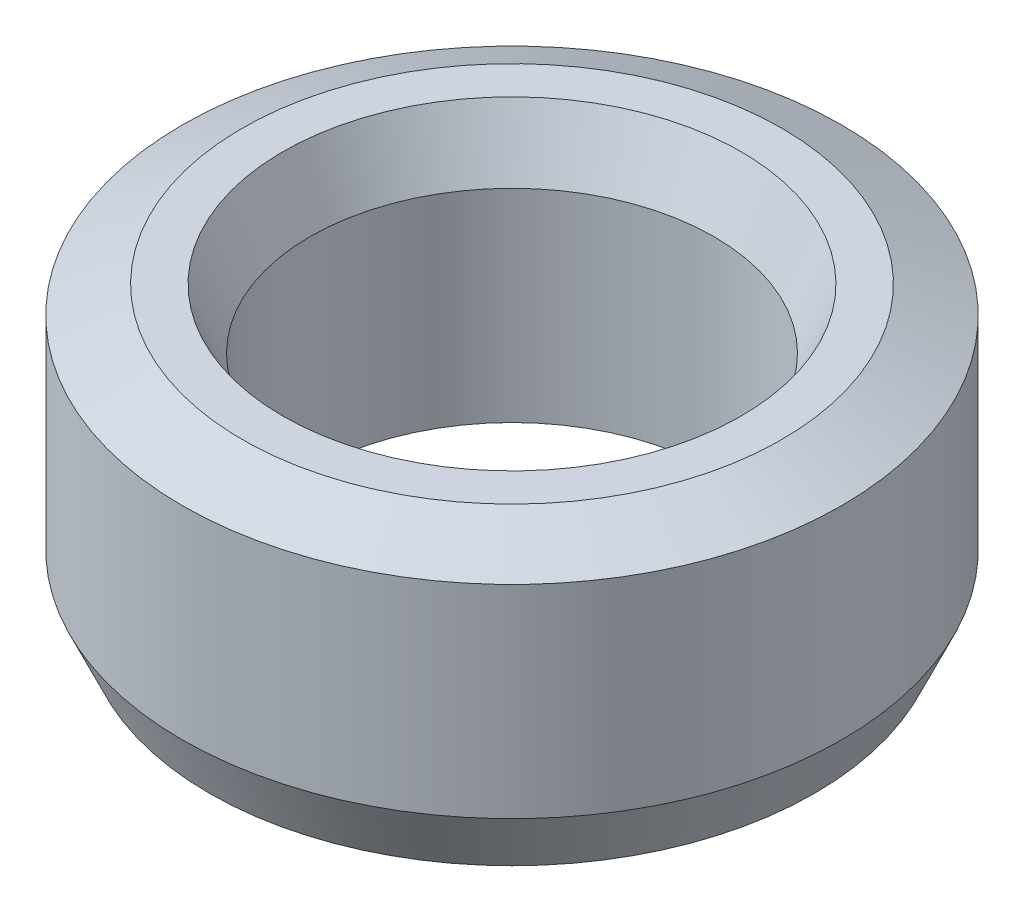
ISO-10303-21;
HEADER;
FILE_DESCRIPTION(('STEP AP214'),'2;1');
FILE_NAME('part.step','',(''),(''),'','','');
FILE_SCHEMA(('AUTOMOTIVE_DESIGN { 1 0 10303 214 1 1 1 1 }'));
ENDSEC;
DATA;
#1=APPLICATION_CONTEXT('core data for automotive mechanical design processes');
#2=APPLICATION_PROTOCOL_DEFINITION('international standard','automotive_design',2000,#1);
#3=PRODUCT_CONTEXT('',#1,'mechanical');
#4=PRODUCT('Part','Part','',(#3));
#5=PRODUCT_RELATED_PRODUCT_CATEGORY('part','',(#4));
#6=PRODUCT_DEFINITION_FORMATION('','',#4);
#7=PRODUCT_DEFINITION_CONTEXT('part definition',#1,'design');
#8=PRODUCT_DEFINITION('design','',#6,#7);
#9=PRODUCT_DEFINITION_SHAPE('','',#8);
#10=(LENGTH_UNIT() NAMED_UNIT(*) SI_UNIT(.MILLI.,.METRE.));
#11=(NAMED_UNIT(*) PLANE_ANGLE_UNIT() SI_UNIT($,.RADIAN.));
#12=(NAMED_UNIT(*) SI_UNIT($,.STERADIAN.) SOLID_ANGLE_UNIT());
#13=UNCERTAINTY_MEASURE_WITH_UNIT(LENGTH_MEASURE(1.E-05),#10,'distance_accuracy_value','');
#14=(GEOMETRIC_REPRESENTATION_CONTEXT(3) GLOBAL_UNCERTAINTY_ASSIGNED_CONTEXT((#13)) GLOBAL_UNIT_ASSIGNED_CONTEXT((#10,
#11,#12)) REPRESENTATION_CONTEXT('',''));
#15=CARTESIAN_POINT('',(0.,0.,0.));
#16=DIRECTION('',(0.,0.,1.));
#17=DIRECTION('',(1.,0.,0.));
#18=AXIS2_PLACEMENT_3D('',#15,#16,#17);
#19=CARTESIAN_POINT('',(0.,32.9867287299585,0.));
#20=DIRECTION('',(0.,-1.,0.));
#21=DIRECTION('',(0.,0.,-1.));
#22=AXIS2_PLACEMENT_3D('',#19,#20,#21);
#23=CYLINDRICAL_SURFACE('',#22,37.5);
#24=CARTESIAN_POINT('',(0.,6.82147116967166,0.));
#25=DIRECTION('',(0.,1.,0.));
#26=DIRECTION('',(0.,0.,1.));
#27=AXIS2_PLACEMENT_3D('',#24,#25,#26);
#28=CIRCLE('',#27,37.5);
#29=CARTESIAN_POINT('',(0.,6.82147116967166,37.5));
#30=VERTEX_POINT('',#29);
#31=EDGE_CURVE('E10',#30,#30,#28,.T.);
#32=ORIENTED_EDGE('',*,*,#31,.T.);
#33=EDGE_LOOP('',(#32));
#34=FACE_BOUND('',#33,.T.);
#35=CARTESIAN_POINT('',(0.,29.8942826603645,0.));
#36=DIRECTION('',(0.,1.,0.));
#37=DIRECTION('',(0.,0.,1.));
#38=AXIS2_PLACEMENT_3D('',#35,#36,#37);
#39=CIRCLE('',#38,37.5);
#40=CARTESIAN_POINT('',(0.,29.8942826603645,-37.5));
#41=VERTEX_POINT('',#40);
#42=EDGE_CURVE('E50',#41,#41,#39,.F.);
#43=ORIENTED_EDGE('',*,*,#42,.T.);
#44=EDGE_LOOP('',(#43));
#45=FACE_BOUND('',#44,.T.);
#46=ADVANCED_FACE('F39',(#34,#45),#23,.T.);
#47=CARTESIAN_POINT('',(0.,32.9867287299585,0.));
#48=DIRECTION('',(0.,1.,0.));
#49=DIRECTION('',(0.,0.,1.));
#50=AXIS2_PLACEMENT_3D('',#47,#48,#49);
#51=PLANE('',#50);
#52=CARTESIAN_POINT('',(0.,32.9867287299585,0.));
#53=DIRECTION('',(0.,1.,0.));
#54=DIRECTION('',(0.,0.,1.));
#55=AXIS2_PLACEMENT_3D('',#52,#53,#54);
#56=CIRCLE('',#55,26.0557640576183);
#57=CARTESIAN_POINT('',(0.,32.9867287299585,26.0557640576183));
#58=VERTEX_POINT('',#57);
#59=EDGE_CURVE('E58',#58,#58,#56,.F.);
#60=ORIENTED_EDGE('',*,*,#59,.T.);
#61=EDGE_LOOP('',(#60));
#62=FACE_BOUND('',#61,.T.);
#63=CARTESIAN_POINT('',(0.,32.9867287299585,0.));
#64=DIRECTION('',(0.,1.,0.));
#65=DIRECTION('',(0.,0.,1.));
#66=AXIS2_PLACEMENT_3D('',#63,#64,#65);
#67=CIRCLE('',#66,30.6785288303284);
#68=CARTESIAN_POINT('',(0.,32.9867287299585,-30.6785288303284));
#69=VERTEX_POINT('',#68);
#70=EDGE_CURVE('E61',#69,#69,#67,.T.);
#71=ORIENTED_EDGE('',*,*,#70,.T.);
#72=EDGE_LOOP('',(#71));
#73=FACE_BOUND('',#72,.T.);
#74=ADVANCED_FACE('F88',(#62,#73),#51,.T.);
#75=CARTESIAN_POINT('',(0.,0.,0.));
#76=DIRECTION('',(0.,1.,0.));
#77=DIRECTION('',(0.,0.,1.));
#78=AXIS2_PLACEMENT_3D('',#75,#76,#77);
#79=PLANE('',#78);
#80=CARTESIAN_POINT('',(0.,0.,0.));
#81=DIRECTION('',(0.,1.,0.));
#82=DIRECTION('',(0.,0.,1.));
#83=AXIS2_PLACEMENT_3D('',#80,#81,#82);
#84=CIRCLE('',#83,29.7847891576959);
#85=CARTESIAN_POINT('',(0.,0.,29.7847891576959));
#86=VERTEX_POINT('',#85);
#87=EDGE_CURVE('E51',#86,#86,#84,.T.);
#88=ORIENTED_EDGE('',*,*,#87,.T.);
#89=EDGE_LOOP('',(#88));
#90=FACE_BOUND('',#89,.T.);
#91=CARTESIAN_POINT('',(0.,0.,0.));
#92=DIRECTION('',(0.,1.,0.));
#93=DIRECTION('',(0.,0.,1.));
#94=AXIS2_PLACEMENT_3D('',#91,#92,#93);
#95=CIRCLE('',#94,34.407553930406);
#96=CARTESIAN_POINT('',(0.,0.,34.407553930406));
#97=VERTEX_POINT('',#96);
#98=EDGE_CURVE('E54',#97,#97,#95,.F.);
#99=ORIENTED_EDGE('',*,*,#98,.T.);
#100=EDGE_LOOP('',(#99));
#101=FACE_BOUND('',#100,.T.);
#102=ADVANCED_FACE('F83',(#90,#101),#79,.F.);
#103=CARTESIAN_POINT('',(0.,32.9867287299585,0.));
#104=DIRECTION('',(0.,-1.,0.));
#105=DIRECTION('',(0.,0.,-1.));
#106=AXIS2_PLACEMENT_3D('',#103,#104,#105);
#107=CYLINDRICAL_SURFACE('',#106,22.9633179880242);
#108=CARTESIAN_POINT('',(0.,26.1652575602868,0.));
#109=DIRECTION('',(0.,1.,0.));
#110=DIRECTION('',(0.,0.,1.));
#111=AXIS2_PLACEMENT_3D('',#108,#109,#110);
#112=CIRCLE('',#111,22.9633179880242);
#113=CARTESIAN_POINT('',(0.,26.1652575602868,22.9633179880242));
#114=VERTEX_POINT('',#113);
#115=EDGE_CURVE('E67',#114,#114,#112,.T.);
#116=ORIENTED_EDGE('',*,*,#115,.T.);
#117=EDGE_LOOP('',(#116));
#118=FACE_BOUND('',#117,.T.);
#119=CARTESIAN_POINT('',(0.,3.09244606959402,0.));
#120=DIRECTION('',(0.,1.,0.));
#121=DIRECTION('',(0.,0.,1.));
#122=AXIS2_PLACEMENT_3D('',#119,#120,#121);
#123=CIRCLE('',#122,22.9633179880242);
#124=CARTESIAN_POINT('',(0.,3.09244606959402,22.9633179880242));
#125=VERTEX_POINT('',#124);
#126=EDGE_CURVE('E69',#125,#125,#123,.F.);
#127=ORIENTED_EDGE('',*,*,#126,.T.);
#128=EDGE_LOOP('',(#127));
#129=FACE_BOUND('',#128,.T.);
#130=ADVANCED_FACE('F71',(#118,#129),#107,.F.);
#131=CARTESIAN_POINT('',(0.,26.1652575602868,0.));
#132=DIRECTION('',(0.,1.,0.));
#133=DIRECTION('',(0.,0.,1.));
#134=AXIS2_PLACEMENT_3D('',#131,#132,#133);
#135=CONICAL_SURFACE('',#134,22.9633179880242,0.425628038556407);
#136=ORIENTED_EDGE('',*,*,#59,.F.);
#137=EDGE_LOOP('',(#136));
#138=FACE_BOUND('',#137,.T.);
#139=ORIENTED_EDGE('',*,*,#115,.F.);
#140=EDGE_LOOP('',(#139));
#141=FACE_BOUND('',#140,.T.);
#142=ADVANCED_FACE('F77',(#138,#141),#135,.F.);
#143=CARTESIAN_POINT('',(0.,0.,0.));
#144=DIRECTION('',(0.,-1.,0.));
#145=DIRECTION('',(0.,0.,-1.));
#146=AXIS2_PLACEMENT_3D('',#143,#144,#145);
#147=CONICAL_SURFACE('',#146,29.7847891576959,1.14516828823849);
#148=ORIENTED_EDGE('',*,*,#126,.F.);
#149=EDGE_LOOP('',(#148));
#150=FACE_BOUND('',#149,.T.);
#151=ORIENTED_EDGE('',*,*,#87,.F.);
#152=EDGE_LOOP('',(#151));
#153=FACE_BOUND('',#152,.T.);
#154=ADVANCED_FACE('F73',(#150,#153),#147,.F.);
#155=CARTESIAN_POINT('',(0.,6.82147116967166,0.));
#156=DIRECTION('',(0.,1.,0.));
#157=DIRECTION('',(0.,0.,1.));
#158=AXIS2_PLACEMENT_3D('',#155,#156,#157);
#159=CONICAL_SURFACE('',#158,37.5,0.425628038556406);
#160=ORIENTED_EDGE('',*,*,#98,.F.);
#161=EDGE_LOOP('',(#160));
#162=FACE_BOUND('',#161,.T.);
#163=ORIENTED_EDGE('',*,*,#31,.F.);
#164=EDGE_LOOP('',(#163));
#165=FACE_BOUND('',#164,.T.);
#166=ADVANCED_FACE('F76',(#162,#165),#159,.T.);
#167=CARTESIAN_POINT('',(0.,32.9867287299585,0.));
#168=DIRECTION('',(0.,-1.,0.));
#169=DIRECTION('',(0.,0.,-1.));
#170=AXIS2_PLACEMENT_3D('',#167,#168,#169);
#171=CONICAL_SURFACE('',#170,30.6785288303284,1.14516828823849);
#172=CARTESIAN_POINT('',(0.,29.8942826603645,-37.5));
#173=CARTESIAN_POINT('',(0.,29.9264956402561,-37.4289430086493));
#174=CARTESIAN_POINT('',(0.,29.9587086201477,-37.3578860172985));
#175=CARTESIAN_POINT('',(0.,30.0231345799309,-37.215772034597));
#176=CARTESIAN_POINT('',(0.,30.0553475598225,-37.1447150432463));
#177=CARTESIAN_POINT('',(0.,30.1197735196057,-37.0026010605448));
#178=CARTESIAN_POINT('',(0.,30.1519864994973,-36.931544069194));
#179=CARTESIAN_POINT('',(0.,30.2164124592805,-36.7894300864925));
#180=CARTESIAN_POINT('',(0.,30.2486254391721,-36.7183730951418));
#181=CARTESIAN_POINT('',(0.,30.3130513989553,-36.5762591124403));
#182=CARTESIAN_POINT('',(0.,30.3452643788469,-36.5052021210896));
#183=CARTESIAN_POINT('',(0.,30.4096903386301,-36.3630881383881));
#184=CARTESIAN_POINT('',(0.,30.4419033185217,-36.2920311470373));
#185=CARTESIAN_POINT('',(0.,30.5063292783049,-36.1499171643358));
#186=CARTESIAN_POINT('',(0.,30.5385422581965,-36.0788601729851));
#187=CARTESIAN_POINT('',(0.,30.6029682179798,-35.9367461902836));
#188=CARTESIAN_POINT('',(0.,30.6351811978714,-35.8656891989328));
#189=CARTESIAN_POINT('',(0.,30.6996071576546,-35.7235752162314));
#190=CARTESIAN_POINT('',(0.,30.7318201375462,-35.6525182248806));
#191=CARTESIAN_POINT('',(0.,30.7962460973294,-35.5104042421791));
#192=CARTESIAN_POINT('',(0.,30.828459077221,-35.4393472508284));
#193=CARTESIAN_POINT('',(0.,30.8928850370042,-35.2972332681269));
#194=CARTESIAN_POINT('',(0.,30.9250980168958,-35.2261762767761));
#195=CARTESIAN_POINT('',(0.,30.989523976679,-35.0840622940746));
#196=CARTESIAN_POINT('',(0.,31.0217369565706,-35.0130053027239));
#197=CARTESIAN_POINT('',(0.,31.0861629163538,-34.8708913200224));
#198=CARTESIAN_POINT('',(0.,31.1183758962454,-34.7998343286717));
#199=CARTESIAN_POINT('',(0.,31.1828018560286,-34.6577203459702));
#200=CARTESIAN_POINT('',(0.,31.2150148359202,-34.5866633546194));
#201=CARTESIAN_POINT('',(0.,31.2794407957035,-34.4445493719179));
#202=CARTESIAN_POINT('',(0.,31.3116537755951,-34.3734923805672));
#203=CARTESIAN_POINT('',(0.,31.3760797353783,-34.2313783978657));
#204=CARTESIAN_POINT('',(0.,31.4082927152699,-34.1603214065149));
#205=CARTESIAN_POINT('',(0.,31.4727186750531,-34.0182074238134));
#206=CARTESIAN_POINT('',(0.,31.5049316549447,-33.9471504324627));
#207=CARTESIAN_POINT('',(0.,31.5693576147279,-33.8050364497612));
#208=CARTESIAN_POINT('',(0.,31.6015705946195,-33.7339794584105));
#209=CARTESIAN_POINT('',(0.,31.6659965544027,-33.591865475709));
#210=CARTESIAN_POINT('',(0.,31.6982095342943,-33.5208084843582));
#211=CARTESIAN_POINT('',(0.,31.7626354940775,-33.3786945016567));
#212=CARTESIAN_POINT('',(0.,31.7948484739691,-33.307637510306));
#213=CARTESIAN_POINT('',(0.,31.8592744337523,-33.1655235276045));
#214=CARTESIAN_POINT('',(0.,31.8914874136439,-33.0944665362537));
#215=CARTESIAN_POINT('',(0.,31.9559133734271,-32.9523525535523));
#216=CARTESIAN_POINT('',(0.,31.9881263533187,-32.8812955622015));
#217=CARTESIAN_POINT('',(0.,32.052552313102,-32.7391815795));
#218=CARTESIAN_POINT('',(0.,32.0847652929936,-32.6681245881493));
#219=CARTESIAN_POINT('',(0.,32.1491912527768,-32.5260106054478));
#220=CARTESIAN_POINT('',(0.,32.1814042326684,-32.454953614097));
#221=CARTESIAN_POINT('',(0.,32.2458301924516,-32.3128396313955));
#222=CARTESIAN_POINT('',(0.,32.2780431723432,-32.2417826400448));
#223=CARTESIAN_POINT('',(0.,32.3424691321264,-32.0996686573433));
#224=CARTESIAN_POINT('',(0.,32.374682112018,-32.0286116659925));
#225=CARTESIAN_POINT('',(0.,32.4391080718012,-31.8864976832911));
#226=CARTESIAN_POINT('',(0.,32.4713210516928,-31.8154406919403));
#227=CARTESIAN_POINT('',(0.,32.535747011476,-31.6733267092388));
#228=CARTESIAN_POINT('',(0.,32.5679599913676,-31.6022697178881));
#229=CARTESIAN_POINT('',(0.,32.6323859511508,-31.4601557351866));
#230=CARTESIAN_POINT('',(0.,32.6645989310424,-31.3890987438358));
#231=CARTESIAN_POINT('',(0.,32.7290248908256,-31.2469847611343));
#232=CARTESIAN_POINT('',(0.,32.7612378707173,-31.1759277697836));
#233=CARTESIAN_POINT('',(0.,32.8256638305005,-31.0338137870821));
#234=CARTESIAN_POINT('',(0.,32.8578768103921,-30.9627567957314));
#235=CARTESIAN_POINT('',(0.,32.9223027701753,-30.8206428130299));
#236=CARTESIAN_POINT('',(0.,32.9545157500669,-30.7495858216791));
#237=CARTESIAN_POINT('',(0.,32.9867287299585,-30.6785288303284));
#238=B_SPLINE_CURVE_WITH_KNOTS('',3,(#172,#173,#174,#175,#176,#177,#178,#179,#180,#181,#182,
#183,#184,#185,#186,#187,#188,#189,#190,#191,#192,#193,#194,#195,#196,#197,#198,#199,#200,#201,
#202,#203,#204,#205,#206,#207,#208,#209,#210,#211,#212,#213,#214,#215,#216,#217,#218,#219,#220,
#221,#222,#223,#224,#225,#226,#227,#228,#229,#230,#231,#232,#233,#234,#235,#236,#237),
.UNSPECIFIED.,.F.,.F.,(4,2,2,2,2,2,2,2,2,2,2,2,2,2,2,2,2,2,2,2,2,2,2,2,2,2,2,2,2,2,2,2,4),(0.,
0.23405330341581,0.468106606831619,0.702159910247429,0.936213213663233,1.17026651707904,
1.40431982049485,1.63837312391066,1.87242642732647,2.10647973074228,2.34053303415808,
2.57458633757389,2.8086396409897,3.04269294440551,3.27674624782132,3.51079955123712,
3.74485285465293,3.97890615806874,4.21295946148455,4.44701276490036,4.68106606831617,
4.91511937173198,5.14917267514779,5.38322597856359,5.6172792819794,5.85133258539521,
6.08538588881102,6.31943919222683,6.55349249564264,6.78754579905845,7.02159910247426,
7.25565240589006,7.48970570930587),.UNSPECIFIED.);
#239=EDGE_CURVE('BSEAM45',#41,#69,#238,.T.);
#240=ORIENTED_EDGE('',*,*,#42,.F.);
#241=ORIENTED_EDGE('',*,*,#70,.F.);
#242=ORIENTED_EDGE('',*,*,#239,.T.);
#243=ORIENTED_EDGE('',*,*,#239,.F.);
#244=EDGE_LOOP('',(#240,#242,#241,#243));
#245=FACE_BOUND('',#244,.T.);
#246=ADVANCED_FACE('F45',(#245),#171,.T.);
#247=CLOSED_SHELL('',(#46,#74,#102,#130,#142,#154,#166,#246));
#248=MANIFOLD_SOLID_BREP('B2',#247);
#249=ADVANCED_BREP_SHAPE_REPRESENTATION('',(#18,#248),#14);
#250=SHAPE_DEFINITION_REPRESENTATION(#9,#249);
ENDSEC;
END-ISO-10303-21;
